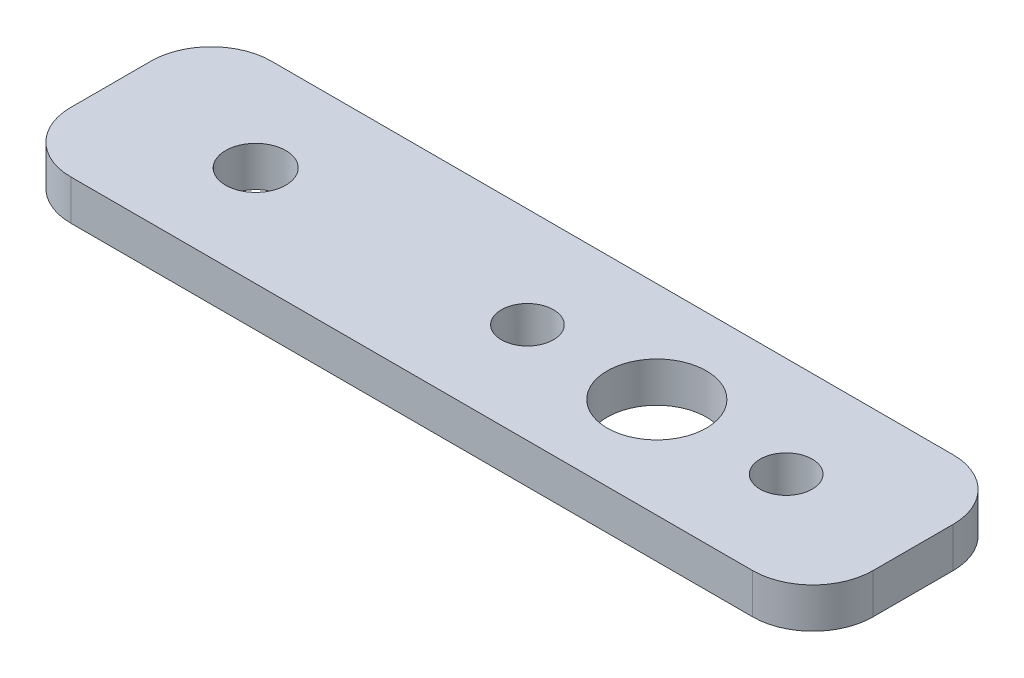
ISO-10303-21;
HEADER;
FILE_DESCRIPTION(('STEP AP214'),'2;1');
FILE_NAME('part.step','',(''),(''),'','','');
FILE_SCHEMA(('AUTOMOTIVE_DESIGN { 1 0 10303 214 1 1 1 1 }'));
ENDSEC;
DATA;
#1=APPLICATION_CONTEXT('core data for automotive mechanical design processes');
#2=APPLICATION_PROTOCOL_DEFINITION('international standard','automotive_design',2000,#1);
#3=PRODUCT_CONTEXT('',#1,'mechanical');
#4=PRODUCT('Part','Part','',(#3));
#5=PRODUCT_RELATED_PRODUCT_CATEGORY('part','',(#4));
#6=PRODUCT_DEFINITION_FORMATION('','',#4);
#7=PRODUCT_DEFINITION_CONTEXT('part definition',#1,'design');
#8=PRODUCT_DEFINITION('design','',#6,#7);
#9=PRODUCT_DEFINITION_SHAPE('','',#8);
#10=(LENGTH_UNIT() NAMED_UNIT(*) SI_UNIT(.MILLI.,.METRE.));
#11=(NAMED_UNIT(*) PLANE_ANGLE_UNIT() SI_UNIT($,.RADIAN.));
#12=(NAMED_UNIT(*) SI_UNIT($,.STERADIAN.) SOLID_ANGLE_UNIT());
#13=UNCERTAINTY_MEASURE_WITH_UNIT(LENGTH_MEASURE(1.E-05),#10,'distance_accuracy_value','');
#14=(GEOMETRIC_REPRESENTATION_CONTEXT(3) GLOBAL_UNCERTAINTY_ASSIGNED_CONTEXT((#13)) GLOBAL_UNIT_ASSIGNED_CONTEXT((#10,
#11,#12)) REPRESENTATION_CONTEXT('',''));
#15=CARTESIAN_POINT('',(0.,0.,0.));
#16=DIRECTION('',(0.,0.,1.));
#17=DIRECTION('',(1.,0.,0.));
#18=AXIS2_PLACEMENT_3D('',#15,#16,#17);
#19=CARTESIAN_POINT('',(20.,2.,-5.));
#20=DIRECTION('',(-1.,0.,0.));
#21=DIRECTION('',(0.,0.,1.));
#22=AXIS2_PLACEMENT_3D('',#19,#20,#21);
#23=PLANE('',#22);
#24=DIRECTION('',(0.,0.,-1.));
#25=VECTOR('',#24,1.);
#26=CARTESIAN_POINT('',(20.,2.,-5.));
#27=LINE('',#26,#25);
#28=CARTESIAN_POINT('',(20.,2.,2.));
#29=VERTEX_POINT('',#28);
#30=CARTESIAN_POINT('',(20.,2.,-2.));
#31=VERTEX_POINT('',#30);
#32=EDGE_CURVE('E128',#29,#31,#27,.T.);
#33=ORIENTED_EDGE('',*,*,#32,.F.);
#34=DIRECTION('',(0.,-1.,0.));
#35=VECTOR('',#34,1.);
#36=CARTESIAN_POINT('',(20.,2.,2.));
#37=LINE('',#36,#35);
#38=CARTESIAN_POINT('',(20.,0.,2.));
#39=VERTEX_POINT('',#38);
#40=EDGE_CURVE('E11',#29,#39,#37,.T.);
#41=ORIENTED_EDGE('',*,*,#40,.T.);
#42=DIRECTION('',(0.,0.,-1.));
#43=VECTOR('',#42,1.);
#44=CARTESIAN_POINT('',(20.,0.,-5.));
#45=LINE('',#44,#43);
#46=CARTESIAN_POINT('',(20.,0.,-2.));
#47=VERTEX_POINT('',#46);
#48=EDGE_CURVE('E130',#39,#47,#45,.T.);
#49=ORIENTED_EDGE('',*,*,#48,.T.);
#50=DIRECTION('',(0.,-1.,0.));
#51=VECTOR('',#50,1.);
#52=CARTESIAN_POINT('',(20.,2.,-2.));
#53=LINE('',#52,#51);
#54=EDGE_CURVE('E41',#47,#31,#53,.F.);
#55=ORIENTED_EDGE('',*,*,#54,.T.);
#56=EDGE_LOOP('',(#33,#41,#49,#55));
#57=FACE_BOUND('',#56,.T.);
#58=ADVANCED_FACE('F33',(#57),#23,.F.);
#59=CARTESIAN_POINT('',(-20.,2.,-5.));
#60=DIRECTION('',(0.,0.,1.));
#61=DIRECTION('',(1.,0.,0.));
#62=AXIS2_PLACEMENT_3D('',#59,#60,#61);
#63=PLANE('',#62);
#64=DIRECTION('',(-1.,0.,0.));
#65=VECTOR('',#64,1.);
#66=CARTESIAN_POINT('',(-20.,0.,-5.));
#67=LINE('',#66,#65);
#68=CARTESIAN_POINT('',(17.,0.,-5.));
#69=VERTEX_POINT('',#68);
#70=CARTESIAN_POINT('',(-17.,0.,-5.));
#71=VERTEX_POINT('',#70);
#72=EDGE_CURVE('E126',#69,#71,#67,.T.);
#73=ORIENTED_EDGE('',*,*,#72,.T.);
#74=DIRECTION('',(0.,-1.,0.));
#75=VECTOR('',#74,1.);
#76=CARTESIAN_POINT('',(-17.,2.,-5.));
#77=LINE('',#76,#75);
#78=CARTESIAN_POINT('',(-17.,2.,-5.));
#79=VERTEX_POINT('',#78);
#80=EDGE_CURVE('E105',#71,#79,#77,.F.);
#81=ORIENTED_EDGE('',*,*,#80,.T.);
#82=DIRECTION('',(-1.,0.,0.));
#83=VECTOR('',#82,1.);
#84=CARTESIAN_POINT('',(-20.,2.,-5.));
#85=LINE('',#84,#83);
#86=CARTESIAN_POINT('',(17.,2.,-5.));
#87=VERTEX_POINT('',#86);
#88=EDGE_CURVE('E176',#87,#79,#85,.T.);
#89=ORIENTED_EDGE('',*,*,#88,.F.);
#90=DIRECTION('',(0.,-1.,0.));
#91=VECTOR('',#90,1.);
#92=CARTESIAN_POINT('',(17.,2.,-5.));
#93=LINE('',#92,#91);
#94=EDGE_CURVE('E110',#87,#69,#93,.T.);
#95=ORIENTED_EDGE('',*,*,#94,.T.);
#96=EDGE_LOOP('',(#73,#81,#89,#95));
#97=FACE_BOUND('',#96,.T.);
#98=ADVANCED_FACE('F180',(#97),#63,.F.);
#99=CARTESIAN_POINT('',(-20.,2.,-5.));
#100=DIRECTION('',(1.,0.,0.));
#101=DIRECTION('',(0.,0.,-1.));
#102=AXIS2_PLACEMENT_3D('',#99,#100,#101);
#103=PLANE('',#102);
#104=DIRECTION('',(0.,0.,1.));
#105=VECTOR('',#104,1.);
#106=CARTESIAN_POINT('',(-20.,2.,-5.));
#107=LINE('',#106,#105);
#108=CARTESIAN_POINT('',(-20.,2.,-2.));
#109=VERTEX_POINT('',#108);
#110=CARTESIAN_POINT('',(-20.,2.,2.));
#111=VERTEX_POINT('',#110);
#112=EDGE_CURVE('E119',#109,#111,#107,.T.);
#113=ORIENTED_EDGE('',*,*,#112,.F.);
#114=DIRECTION('',(0.,-1.,0.));
#115=VECTOR('',#114,1.);
#116=CARTESIAN_POINT('',(-20.,2.,-2.));
#117=LINE('',#116,#115);
#118=CARTESIAN_POINT('',(-20.,0.,-2.));
#119=VERTEX_POINT('',#118);
#120=EDGE_CURVE('E104',#109,#119,#117,.T.);
#121=ORIENTED_EDGE('',*,*,#120,.T.);
#122=DIRECTION('',(0.,0.,1.));
#123=VECTOR('',#122,1.);
#124=CARTESIAN_POINT('',(-20.,0.,-5.));
#125=LINE('',#124,#123);
#126=CARTESIAN_POINT('',(-20.,0.,2.));
#127=VERTEX_POINT('',#126);
#128=EDGE_CURVE('E117',#119,#127,#125,.T.);
#129=ORIENTED_EDGE('',*,*,#128,.T.);
#130=DIRECTION('',(0.,-1.,0.));
#131=VECTOR('',#130,1.);
#132=CARTESIAN_POINT('',(-20.,2.,2.));
#133=LINE('',#132,#131);
#134=EDGE_CURVE('E121',#127,#111,#133,.F.);
#135=ORIENTED_EDGE('',*,*,#134,.T.);
#136=EDGE_LOOP('',(#113,#121,#129,#135));
#137=FACE_BOUND('',#136,.T.);
#138=ADVANCED_FACE('F116',(#137),#103,.F.);
#139=CARTESIAN_POINT('',(-20.,2.,5.));
#140=DIRECTION('',(0.,0.,-1.));
#141=DIRECTION('',(-1.,0.,0.));
#142=AXIS2_PLACEMENT_3D('',#139,#140,#141);
#143=PLANE('',#142);
#144=DIRECTION('',(1.,0.,0.));
#145=VECTOR('',#144,1.);
#146=CARTESIAN_POINT('',(-20.,2.,5.));
#147=LINE('',#146,#145);
#148=CARTESIAN_POINT('',(-17.,2.,5.));
#149=VERTEX_POINT('',#148);
#150=CARTESIAN_POINT('',(17.,2.,5.));
#151=VERTEX_POINT('',#150);
#152=EDGE_CURVE('E144',#149,#151,#147,.T.);
#153=ORIENTED_EDGE('',*,*,#152,.F.);
#154=DIRECTION('',(0.,-1.,0.));
#155=VECTOR('',#154,1.);
#156=CARTESIAN_POINT('',(-17.,2.,5.));
#157=LINE('',#156,#155);
#158=CARTESIAN_POINT('',(-17.,0.,5.));
#159=VERTEX_POINT('',#158);
#160=EDGE_CURVE('E161',#149,#159,#157,.T.);
#161=ORIENTED_EDGE('',*,*,#160,.T.);
#162=DIRECTION('',(1.,0.,0.));
#163=VECTOR('',#162,1.);
#164=CARTESIAN_POINT('',(-20.,0.,5.));
#165=LINE('',#164,#163);
#166=CARTESIAN_POINT('',(17.,0.,5.));
#167=VERTEX_POINT('',#166);
#168=EDGE_CURVE('E125',#159,#167,#165,.T.);
#169=ORIENTED_EDGE('',*,*,#168,.T.);
#170=DIRECTION('',(0.,-1.,0.));
#171=VECTOR('',#170,1.);
#172=CARTESIAN_POINT('',(17.,2.,5.));
#173=LINE('',#172,#171);
#174=EDGE_CURVE('E48',#167,#151,#173,.F.);
#175=ORIENTED_EDGE('',*,*,#174,.T.);
#176=EDGE_LOOP('',(#153,#161,#169,#175));
#177=FACE_BOUND('',#176,.T.);
#178=ADVANCED_FACE('F204',(#177),#143,.F.);
#179=CARTESIAN_POINT('',(0.,2.,0.));
#180=DIRECTION('',(0.,1.,0.));
#181=DIRECTION('',(0.,0.,1.));
#182=AXIS2_PLACEMENT_3D('',#179,#180,#181);
#183=PLANE('',#182);
#184=CARTESIAN_POINT('',(-12.7800814139349,2.,0.));
#185=DIRECTION('',(0.,1.,0.));
#186=DIRECTION('',(0.,0.,1.));
#187=AXIS2_PLACEMENT_3D('',#184,#185,#186);
#188=CIRCLE('',#187,1.5);
#189=CARTESIAN_POINT('',(-12.7800814139349,2.,1.5));
#190=VERTEX_POINT('',#189);
#191=EDGE_CURVE('E196',#190,#190,#188,.T.);
#192=ORIENTED_EDGE('',*,*,#191,.F.);
#193=EDGE_LOOP('',(#192));
#194=FACE_BOUND('',#193,.T.);
#195=CARTESIAN_POINT('',(13.6699185860651,2.,0.));
#196=DIRECTION('',(0.,1.,0.));
#197=DIRECTION('',(0.,0.,1.));
#198=AXIS2_PLACEMENT_3D('',#195,#196,#197);
#199=CIRCLE('',#198,1.3);
#200=CARTESIAN_POINT('',(13.6699185860651,2.,1.3));
#201=VERTEX_POINT('',#200);
#202=EDGE_CURVE('E188',#201,#201,#199,.T.);
#203=ORIENTED_EDGE('',*,*,#202,.F.);
#204=EDGE_LOOP('',(#203));
#205=FACE_BOUND('',#204,.T.);
#206=CARTESIAN_POINT('',(0.76991858606508,2.,0.));
#207=DIRECTION('',(0.,1.,0.));
#208=DIRECTION('',(0.,0.,-1.));
#209=AXIS2_PLACEMENT_3D('',#206,#207,#208);
#210=CIRCLE('',#209,1.3);
#211=CARTESIAN_POINT('',(0.76991858606508,2.,-1.3));
#212=VERTEX_POINT('',#211);
#213=EDGE_CURVE('E187',#212,#212,#210,.T.);
#214=ORIENTED_EDGE('',*,*,#213,.F.);
#215=EDGE_LOOP('',(#214));
#216=FACE_BOUND('',#215,.T.);
#217=CARTESIAN_POINT('',(7.21991858606508,2.,0.));
#218=DIRECTION('',(0.,1.,0.));
#219=DIRECTION('',(0.,0.,1.));
#220=AXIS2_PLACEMENT_3D('',#217,#218,#219);
#221=CIRCLE('',#220,2.47286435846186);
#222=CARTESIAN_POINT('',(7.21991858606508,2.,2.47286435846186));
#223=VERTEX_POINT('',#222);
#224=EDGE_CURVE('E138',#223,#223,#221,.T.);
#225=ORIENTED_EDGE('',*,*,#224,.F.);
#226=EDGE_LOOP('',(#225));
#227=FACE_BOUND('',#226,.T.);
#228=ORIENTED_EDGE('',*,*,#88,.T.);
#229=CARTESIAN_POINT('',(-17.,2.,-2.));
#230=DIRECTION('',(0.,1.,0.));
#231=DIRECTION('',(0.,0.,1.));
#232=AXIS2_PLACEMENT_3D('',#229,#230,#231);
#233=CIRCLE('',#232,3.);
#234=EDGE_CURVE('E158',#79,#109,#233,.T.);
#235=ORIENTED_EDGE('',*,*,#234,.T.);
#236=ORIENTED_EDGE('',*,*,#112,.T.);
#237=CARTESIAN_POINT('',(-17.,2.,2.));
#238=DIRECTION('',(0.,1.,0.));
#239=DIRECTION('',(0.,0.,1.));
#240=AXIS2_PLACEMENT_3D('',#237,#238,#239);
#241=CIRCLE('',#240,3.);
#242=EDGE_CURVE('E55',#111,#149,#241,.T.);
#243=ORIENTED_EDGE('',*,*,#242,.T.);
#244=ORIENTED_EDGE('',*,*,#152,.T.);
#245=CARTESIAN_POINT('',(17.,2.,2.));
#246=DIRECTION('',(0.,1.,0.));
#247=DIRECTION('',(0.,0.,1.));
#248=AXIS2_PLACEMENT_3D('',#245,#246,#247);
#249=CIRCLE('',#248,3.);
#250=EDGE_CURVE('E155',#151,#29,#249,.T.);
#251=ORIENTED_EDGE('',*,*,#250,.T.);
#252=ORIENTED_EDGE('',*,*,#32,.T.);
#253=CARTESIAN_POINT('',(17.,2.,-2.));
#254=DIRECTION('',(0.,1.,0.));
#255=DIRECTION('',(0.,0.,1.));
#256=AXIS2_PLACEMENT_3D('',#253,#254,#255);
#257=CIRCLE('',#256,3.);
#258=EDGE_CURVE('E153',#31,#87,#257,.T.);
#259=ORIENTED_EDGE('',*,*,#258,.T.);
#260=EDGE_LOOP('',(#228,#235,#236,#243,#244,#251,#252,#259));
#261=FACE_BOUND('',#260,.T.);
#262=ADVANCED_FACE('F173',(#194,#205,#216,#227,#261),#183,.T.);
#263=CARTESIAN_POINT('',(0.,0.,0.));
#264=DIRECTION('',(0.,1.,0.));
#265=DIRECTION('',(0.,0.,1.));
#266=AXIS2_PLACEMENT_3D('',#263,#264,#265);
#267=PLANE('',#266);
#268=CARTESIAN_POINT('',(-12.7800814139349,0.,0.));
#269=DIRECTION('',(0.,1.,0.));
#270=DIRECTION('',(0.,0.,1.));
#271=AXIS2_PLACEMENT_3D('',#268,#269,#270);
#272=CIRCLE('',#271,1.5);
#273=CARTESIAN_POINT('',(-12.7800814139349,0.,1.5));
#274=VERTEX_POINT('',#273);
#275=EDGE_CURVE('E191',#274,#274,#272,.T.);
#276=ORIENTED_EDGE('',*,*,#275,.T.);
#277=EDGE_LOOP('',(#276));
#278=FACE_BOUND('',#277,.T.);
#279=CARTESIAN_POINT('',(13.6699185860651,0.,0.));
#280=DIRECTION('',(0.,1.,0.));
#281=DIRECTION('',(0.,0.,1.));
#282=AXIS2_PLACEMENT_3D('',#279,#280,#281);
#283=CIRCLE('',#282,1.3);
#284=CARTESIAN_POINT('',(13.6699185860651,0.,1.3));
#285=VERTEX_POINT('',#284);
#286=EDGE_CURVE('E141',#285,#285,#283,.T.);
#287=ORIENTED_EDGE('',*,*,#286,.T.);
#288=EDGE_LOOP('',(#287));
#289=FACE_BOUND('',#288,.T.);
#290=CARTESIAN_POINT('',(0.76991858606508,0.,0.));
#291=DIRECTION('',(0.,1.,0.));
#292=DIRECTION('',(0.,0.,1.));
#293=AXIS2_PLACEMENT_3D('',#290,#291,#292);
#294=CIRCLE('',#293,1.3);
#295=CARTESIAN_POINT('',(0.76991858606508,0.,1.3));
#296=VERTEX_POINT('',#295);
#297=EDGE_CURVE('E137',#296,#296,#294,.T.);
#298=ORIENTED_EDGE('',*,*,#297,.T.);
#299=EDGE_LOOP('',(#298));
#300=FACE_BOUND('',#299,.T.);
#301=CARTESIAN_POINT('',(7.21991858606508,0.,0.));
#302=DIRECTION('',(0.,1.,0.));
#303=DIRECTION('',(0.,0.,1.));
#304=AXIS2_PLACEMENT_3D('',#301,#302,#303);
#305=CIRCLE('',#304,2.47286435846186);
#306=CARTESIAN_POINT('',(7.21991858606508,0.,2.47286435846186));
#307=VERTEX_POINT('',#306);
#308=EDGE_CURVE('E134',#307,#307,#305,.T.);
#309=ORIENTED_EDGE('',*,*,#308,.T.);
#310=EDGE_LOOP('',(#309));
#311=FACE_BOUND('',#310,.T.);
#312=ORIENTED_EDGE('',*,*,#128,.F.);
#313=CARTESIAN_POINT('',(-17.,0.,-2.));
#314=DIRECTION('',(0.,1.,0.));
#315=DIRECTION('',(0.,0.,1.));
#316=AXIS2_PLACEMENT_3D('',#313,#314,#315);
#317=CIRCLE('',#316,3.);
#318=EDGE_CURVE('E100',#119,#71,#317,.F.);
#319=ORIENTED_EDGE('',*,*,#318,.T.);
#320=ORIENTED_EDGE('',*,*,#72,.F.);
#321=CARTESIAN_POINT('',(17.,0.,-2.));
#322=DIRECTION('',(0.,1.,0.));
#323=DIRECTION('',(0.,0.,1.));
#324=AXIS2_PLACEMENT_3D('',#321,#322,#323);
#325=CIRCLE('',#324,3.);
#326=EDGE_CURVE('E120',#69,#47,#325,.F.);
#327=ORIENTED_EDGE('',*,*,#326,.T.);
#328=ORIENTED_EDGE('',*,*,#48,.F.);
#329=CARTESIAN_POINT('',(17.,0.,2.));
#330=DIRECTION('',(0.,1.,0.));
#331=DIRECTION('',(0.,0.,1.));
#332=AXIS2_PLACEMENT_3D('',#329,#330,#331);
#333=CIRCLE('',#332,3.);
#334=EDGE_CURVE('E147',#39,#167,#333,.F.);
#335=ORIENTED_EDGE('',*,*,#334,.T.);
#336=ORIENTED_EDGE('',*,*,#168,.F.);
#337=CARTESIAN_POINT('',(-17.,0.,2.));
#338=DIRECTION('',(0.,1.,0.));
#339=DIRECTION('',(0.,0.,1.));
#340=AXIS2_PLACEMENT_3D('',#337,#338,#339);
#341=CIRCLE('',#340,3.);
#342=EDGE_CURVE('E111',#159,#127,#341,.F.);
#343=ORIENTED_EDGE('',*,*,#342,.T.);
#344=EDGE_LOOP('',(#312,#319,#320,#327,#328,#335,#336,#343));
#345=FACE_BOUND('',#344,.T.);
#346=ADVANCED_FACE('F123',(#278,#289,#300,#311,#345),#267,.F.);
#347=CARTESIAN_POINT('',(7.21991858606508,-1.,0.));
#348=DIRECTION('',(0.,1.,0.));
#349=DIRECTION('',(0.,0.,1.));
#350=AXIS2_PLACEMENT_3D('',#347,#348,#349);
#351=CYLINDRICAL_SURFACE('',#350,2.47286435846186);
#352=ORIENTED_EDGE('',*,*,#224,.T.);
#353=EDGE_LOOP('',(#352));
#354=FACE_BOUND('',#353,.T.);
#355=ORIENTED_EDGE('',*,*,#308,.F.);
#356=EDGE_LOOP('',(#355));
#357=FACE_BOUND('',#356,.T.);
#358=ADVANCED_FACE('F212',(#354,#357),#351,.F.);
#359=CARTESIAN_POINT('',(0.76991858606508,-1.,0.));
#360=DIRECTION('',(0.,1.,0.));
#361=DIRECTION('',(0.,0.,1.));
#362=AXIS2_PLACEMENT_3D('',#359,#360,#361);
#363=CYLINDRICAL_SURFACE('',#362,1.3);
#364=ORIENTED_EDGE('',*,*,#213,.T.);
#365=EDGE_LOOP('',(#364));
#366=FACE_BOUND('',#365,.T.);
#367=ORIENTED_EDGE('',*,*,#297,.F.);
#368=EDGE_LOOP('',(#367));
#369=FACE_BOUND('',#368,.T.);
#370=ADVANCED_FACE('F215',(#366,#369),#363,.F.);
#371=CARTESIAN_POINT('',(13.6699185860651,-1.,0.));
#372=DIRECTION('',(0.,1.,0.));
#373=DIRECTION('',(0.,0.,1.));
#374=AXIS2_PLACEMENT_3D('',#371,#372,#373);
#375=CYLINDRICAL_SURFACE('',#374,1.3);
#376=ORIENTED_EDGE('',*,*,#202,.T.);
#377=EDGE_LOOP('',(#376));
#378=FACE_BOUND('',#377,.T.);
#379=ORIENTED_EDGE('',*,*,#286,.F.);
#380=EDGE_LOOP('',(#379));
#381=FACE_BOUND('',#380,.T.);
#382=ADVANCED_FACE('F237',(#378,#381),#375,.F.);
#383=CARTESIAN_POINT('',(-17.,2.,-2.));
#384=DIRECTION('',(0.,-1.,0.));
#385=DIRECTION('',(0.,0.,-1.));
#386=AXIS2_PLACEMENT_3D('',#383,#384,#385);
#387=CYLINDRICAL_SURFACE('',#386,3.);
#388=ORIENTED_EDGE('',*,*,#234,.F.);
#389=ORIENTED_EDGE('',*,*,#80,.F.);
#390=ORIENTED_EDGE('',*,*,#318,.F.);
#391=ORIENTED_EDGE('',*,*,#120,.F.);
#392=EDGE_LOOP('',(#388,#389,#390,#391));
#393=FACE_BOUND('',#392,.T.);
#394=ADVANCED_FACE('F103',(#393),#387,.T.);
#395=CARTESIAN_POINT('',(-17.,2.,2.));
#396=DIRECTION('',(0.,-1.,0.));
#397=DIRECTION('',(0.,0.,-1.));
#398=AXIS2_PLACEMENT_3D('',#395,#396,#397);
#399=CYLINDRICAL_SURFACE('',#398,3.);
#400=ORIENTED_EDGE('',*,*,#242,.F.);
#401=ORIENTED_EDGE('',*,*,#134,.F.);
#402=ORIENTED_EDGE('',*,*,#342,.F.);
#403=ORIENTED_EDGE('',*,*,#160,.F.);
#404=EDGE_LOOP('',(#400,#401,#402,#403));
#405=FACE_BOUND('',#404,.T.);
#406=ADVANCED_FACE('F236',(#405),#399,.T.);
#407=CARTESIAN_POINT('',(17.,2.,2.));
#408=DIRECTION('',(0.,-1.,0.));
#409=DIRECTION('',(0.,0.,-1.));
#410=AXIS2_PLACEMENT_3D('',#407,#408,#409);
#411=CYLINDRICAL_SURFACE('',#410,3.);
#412=ORIENTED_EDGE('',*,*,#250,.F.);
#413=ORIENTED_EDGE('',*,*,#174,.F.);
#414=ORIENTED_EDGE('',*,*,#334,.F.);
#415=ORIENTED_EDGE('',*,*,#40,.F.);
#416=EDGE_LOOP('',(#412,#413,#414,#415));
#417=FACE_BOUND('',#416,.T.);
#418=ADVANCED_FACE('F239',(#417),#411,.T.);
#419=CARTESIAN_POINT('',(17.,2.,-2.));
#420=DIRECTION('',(0.,-1.,0.));
#421=DIRECTION('',(0.,0.,-1.));
#422=AXIS2_PLACEMENT_3D('',#419,#420,#421);
#423=CYLINDRICAL_SURFACE('',#422,3.);
#424=ORIENTED_EDGE('',*,*,#258,.F.);
#425=ORIENTED_EDGE('',*,*,#54,.F.);
#426=ORIENTED_EDGE('',*,*,#326,.F.);
#427=ORIENTED_EDGE('',*,*,#94,.F.);
#428=EDGE_LOOP('',(#424,#425,#426,#427));
#429=FACE_BOUND('',#428,.T.);
#430=ADVANCED_FACE('F35',(#429),#423,.T.);
#431=CARTESIAN_POINT('',(-12.7800814139349,2.,0.));
#432=DIRECTION('',(0.,1.,0.));
#433=DIRECTION('',(0.,0.,1.));
#434=AXIS2_PLACEMENT_3D('',#431,#432,#433);
#435=CYLINDRICAL_SURFACE('',#434,1.5);
#436=ORIENTED_EDGE('',*,*,#275,.F.);
#437=EDGE_LOOP('',(#436));
#438=FACE_BOUND('',#437,.T.);
#439=ORIENTED_EDGE('',*,*,#191,.T.);
#440=EDGE_LOOP('',(#439));
#441=FACE_BOUND('',#440,.T.);
#442=ADVANCED_FACE('F200',(#438,#441),#435,.F.);
#443=CLOSED_SHELL('',(#58,#98,#138,#178,#262,#346,#358,#370,#382,#394,#406,#418,#430,#442));
#444=MANIFOLD_SOLID_BREP('B2',#443);
#445=ADVANCED_BREP_SHAPE_REPRESENTATION('',(#18,#444),#14);
#446=SHAPE_DEFINITION_REPRESENTATION(#9,#445);
ENDSEC;
END-ISO-10303-21;
